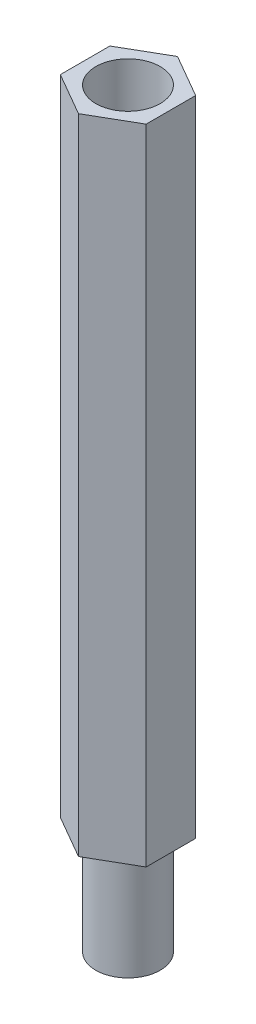
ISO-10303-21;
HEADER;
FILE_DESCRIPTION(('STEP AP214'),'2;1');
FILE_NAME('part.step','',(''),(''),'','','');
FILE_SCHEMA(('AUTOMOTIVE_DESIGN { 1 0 10303 214 1 1 1 1 }'));
ENDSEC;
DATA;
#1=APPLICATION_CONTEXT('core data for automotive mechanical design processes');
#2=APPLICATION_PROTOCOL_DEFINITION('international standard','automotive_design',2000,#1);
#3=PRODUCT_CONTEXT('',#1,'mechanical');
#4=PRODUCT('Part','Part','',(#3));
#5=PRODUCT_RELATED_PRODUCT_CATEGORY('part','',(#4));
#6=PRODUCT_DEFINITION_FORMATION('','',#4);
#7=PRODUCT_DEFINITION_CONTEXT('part definition',#1,'design');
#8=PRODUCT_DEFINITION('design','',#6,#7);
#9=PRODUCT_DEFINITION_SHAPE('','',#8);
#10=(LENGTH_UNIT() NAMED_UNIT(*) SI_UNIT(.MILLI.,.METRE.));
#11=(NAMED_UNIT(*) PLANE_ANGLE_UNIT() SI_UNIT($,.RADIAN.));
#12=(NAMED_UNIT(*) SI_UNIT($,.STERADIAN.) SOLID_ANGLE_UNIT());
#13=UNCERTAINTY_MEASURE_WITH_UNIT(LENGTH_MEASURE(1.E-05),#10,'distance_accuracy_value','');
#14=(GEOMETRIC_REPRESENTATION_CONTEXT(3) GLOBAL_UNCERTAINTY_ASSIGNED_CONTEXT((#13)) GLOBAL_UNIT_ASSIGNED_CONTEXT((#10,
#11,#12)) REPRESENTATION_CONTEXT('',''));
#15=CARTESIAN_POINT('',(0.,0.,0.));
#16=DIRECTION('',(0.,0.,1.));
#17=DIRECTION('',(1.,0.,0.));
#18=AXIS2_PLACEMENT_3D('',#15,#16,#17);
#19=CARTESIAN_POINT('',(0.,5.,0.));
#20=DIRECTION('',(0.,-1.,0.));
#21=DIRECTION('',(0.,0.,-1.));
#22=AXIS2_PLACEMENT_3D('',#19,#20,#21);
#23=CYLINDRICAL_SURFACE('',#22,1.5);
#24=CARTESIAN_POINT('',(0.,5.,0.));
#25=DIRECTION('',(0.,1.,0.));
#26=DIRECTION('',(0.,0.,1.));
#27=AXIS2_PLACEMENT_3D('',#24,#25,#26);
#28=CIRCLE('',#27,1.5);
#29=CARTESIAN_POINT('',(0.,5.,1.5));
#30=VERTEX_POINT('',#29);
#31=EDGE_CURVE('E11',#30,#30,#28,.T.);
#32=ORIENTED_EDGE('',*,*,#31,.F.);
#33=EDGE_LOOP('',(#32));
#34=FACE_BOUND('',#33,.T.);
#35=CARTESIAN_POINT('',(0.,0.,0.));
#36=DIRECTION('',(0.,1.,0.));
#37=DIRECTION('',(0.,0.,1.));
#38=AXIS2_PLACEMENT_3D('',#35,#36,#37);
#39=CIRCLE('',#38,1.5);
#40=CARTESIAN_POINT('',(0.,0.,1.5));
#41=VERTEX_POINT('',#40);
#42=EDGE_CURVE('E37',#41,#41,#39,.T.);
#43=ORIENTED_EDGE('',*,*,#42,.T.);
#44=EDGE_LOOP('',(#43));
#45=FACE_BOUND('',#44,.T.);
#46=ADVANCED_FACE('F34',(#34,#45),#23,.T.);
#47=CARTESIAN_POINT('',(0.,0.,0.));
#48=DIRECTION('',(0.,1.,0.));
#49=DIRECTION('',(0.,0.,1.));
#50=AXIS2_PLACEMENT_3D('',#47,#48,#49);
#51=PLANE('',#50);
#52=ORIENTED_EDGE('',*,*,#42,.F.);
#53=EDGE_LOOP('',(#52));
#54=FACE_BOUND('',#53,.T.);
#55=ADVANCED_FACE('F143',(#54),#51,.F.);
#56=CARTESIAN_POINT('',(2.,35.,-1.15470053837925));
#57=DIRECTION('',(-0.5,0.,0.866025403784438));
#58=DIRECTION('',(0.866025403784439,0.,0.5));
#59=AXIS2_PLACEMENT_3D('',#56,#57,#58);
#60=PLANE('',#59);
#61=DIRECTION('',(-0.866025403784438,0.,-0.5));
#62=VECTOR('',#61,1.);
#63=CARTESIAN_POINT('',(2.,5.,-1.15470053837925));
#64=LINE('',#63,#62);
#65=CARTESIAN_POINT('',(2.,5.,-1.15470053837925));
#66=VERTEX_POINT('',#65);
#67=CARTESIAN_POINT('',(0.,5.,-2.3094010767585));
#68=VERTEX_POINT('',#67);
#69=EDGE_CURVE('E119',#66,#68,#64,.T.);
#70=ORIENTED_EDGE('',*,*,#69,.T.);
#71=DIRECTION('',(0.,-1.,0.));
#72=VECTOR('',#71,1.);
#73=CARTESIAN_POINT('',(0.,35.,-2.3094010767585));
#74=LINE('',#73,#72);
#75=CARTESIAN_POINT('',(0.,35.,-2.3094010767585));
#76=VERTEX_POINT('',#75);
#77=EDGE_CURVE('E137',#76,#68,#74,.T.);
#78=ORIENTED_EDGE('',*,*,#77,.F.);
#79=DIRECTION('',(-0.866025403784438,0.,-0.5));
#80=VECTOR('',#79,1.);
#81=CARTESIAN_POINT('',(2.,35.,-1.15470053837925));
#82=LINE('',#81,#80);
#83=CARTESIAN_POINT('',(2.,35.,-1.15470053837925));
#84=VERTEX_POINT('',#83);
#85=EDGE_CURVE('E130',#84,#76,#82,.T.);
#86=ORIENTED_EDGE('',*,*,#85,.F.);
#87=DIRECTION('',(0.,-1.,0.));
#88=VECTOR('',#87,1.);
#89=CARTESIAN_POINT('',(2.,35.,-1.15470053837925));
#90=LINE('',#89,#88);
#91=EDGE_CURVE('E115',#84,#66,#90,.T.);
#92=ORIENTED_EDGE('',*,*,#91,.T.);
#93=EDGE_LOOP('',(#70,#78,#86,#92));
#94=FACE_BOUND('',#93,.T.);
#95=ADVANCED_FACE('F145',(#94),#60,.F.);
#96=CARTESIAN_POINT('',(0.,35.,-2.3094010767585));
#97=DIRECTION('',(0.5,0.,0.866025403784439));
#98=DIRECTION('',(0.866025403784439,0.,-0.5));
#99=AXIS2_PLACEMENT_3D('',#96,#97,#98);
#100=PLANE('',#99);
#101=DIRECTION('',(-0.866025403784439,0.,0.5));
#102=VECTOR('',#101,1.);
#103=CARTESIAN_POINT('',(0.,5.,-2.3094010767585));
#104=LINE('',#103,#102);
#105=CARTESIAN_POINT('',(-2.,5.,-1.15470053837925));
#106=VERTEX_POINT('',#105);
#107=EDGE_CURVE('E122',#68,#106,#104,.T.);
#108=ORIENTED_EDGE('',*,*,#107,.T.);
#109=DIRECTION('',(0.,-1.,0.));
#110=VECTOR('',#109,1.);
#111=CARTESIAN_POINT('',(-2.,35.,-1.15470053837925));
#112=LINE('',#111,#110);
#113=CARTESIAN_POINT('',(-2.,35.,-1.15470053837925));
#114=VERTEX_POINT('',#113);
#115=EDGE_CURVE('E134',#114,#106,#112,.T.);
#116=ORIENTED_EDGE('',*,*,#115,.F.);
#117=DIRECTION('',(-0.866025403784439,0.,0.5));
#118=VECTOR('',#117,1.);
#119=CARTESIAN_POINT('',(0.,35.,-2.3094010767585));
#120=LINE('',#119,#118);
#121=EDGE_CURVE('E88',#76,#114,#120,.T.);
#122=ORIENTED_EDGE('',*,*,#121,.F.);
#123=ORIENTED_EDGE('',*,*,#77,.T.);
#124=EDGE_LOOP('',(#108,#116,#122,#123));
#125=FACE_BOUND('',#124,.T.);
#126=ADVANCED_FACE('F150',(#125),#100,.F.);
#127=CARTESIAN_POINT('',(-2.,35.,-1.15470053837925));
#128=DIRECTION('',(1.,0.,0.));
#129=DIRECTION('',(0.,0.,-1.));
#130=AXIS2_PLACEMENT_3D('',#127,#128,#129);
#131=PLANE('',#130);
#132=DIRECTION('',(0.,0.,1.));
#133=VECTOR('',#132,1.);
#134=CARTESIAN_POINT('',(-2.,5.,-1.15470053837925));
#135=LINE('',#134,#133);
#136=CARTESIAN_POINT('',(-2.,5.,1.15470053837925));
#137=VERTEX_POINT('',#136);
#138=EDGE_CURVE('E125',#106,#137,#135,.T.);
#139=ORIENTED_EDGE('',*,*,#138,.T.);
#140=DIRECTION('',(0.,-1.,0.));
#141=VECTOR('',#140,1.);
#142=CARTESIAN_POINT('',(-2.,35.,1.15470053837925));
#143=LINE('',#142,#141);
#144=CARTESIAN_POINT('',(-2.,35.,1.15470053837925));
#145=VERTEX_POINT('',#144);
#146=EDGE_CURVE('E110',#145,#137,#143,.T.);
#147=ORIENTED_EDGE('',*,*,#146,.F.);
#148=DIRECTION('',(0.,0.,1.));
#149=VECTOR('',#148,1.);
#150=CARTESIAN_POINT('',(-2.,35.,-1.15470053837925));
#151=LINE('',#150,#149);
#152=EDGE_CURVE('E101',#114,#145,#151,.T.);
#153=ORIENTED_EDGE('',*,*,#152,.F.);
#154=ORIENTED_EDGE('',*,*,#115,.T.);
#155=EDGE_LOOP('',(#139,#147,#153,#154));
#156=FACE_BOUND('',#155,.T.);
#157=ADVANCED_FACE('F157',(#156),#131,.F.);
#158=CARTESIAN_POINT('',(-2.,35.,1.15470053837925));
#159=DIRECTION('',(0.5,0.,-0.866025403784438));
#160=DIRECTION('',(-0.866025403784438,0.,-0.5));
#161=AXIS2_PLACEMENT_3D('',#158,#159,#160);
#162=PLANE('',#161);
#163=DIRECTION('',(0.866025403784438,0.,0.5));
#164=VECTOR('',#163,1.);
#165=CARTESIAN_POINT('',(-2.,5.,1.15470053837925));
#166=LINE('',#165,#164);
#167=CARTESIAN_POINT('',(0.,5.,2.3094010767585));
#168=VERTEX_POINT('',#167);
#169=EDGE_CURVE('E109',#137,#168,#166,.T.);
#170=ORIENTED_EDGE('',*,*,#169,.T.);
#171=DIRECTION('',(0.,-1.,0.));
#172=VECTOR('',#171,1.);
#173=CARTESIAN_POINT('',(0.,35.,2.3094010767585));
#174=LINE('',#173,#172);
#175=CARTESIAN_POINT('',(0.,35.,2.3094010767585));
#176=VERTEX_POINT('',#175);
#177=EDGE_CURVE('E106',#176,#168,#174,.T.);
#178=ORIENTED_EDGE('',*,*,#177,.F.);
#179=DIRECTION('',(0.866025403784438,0.,0.5));
#180=VECTOR('',#179,1.);
#181=CARTESIAN_POINT('',(-2.,35.,1.15470053837925));
#182=LINE('',#181,#180);
#183=EDGE_CURVE('E95',#145,#176,#182,.T.);
#184=ORIENTED_EDGE('',*,*,#183,.F.);
#185=ORIENTED_EDGE('',*,*,#146,.T.);
#186=EDGE_LOOP('',(#170,#178,#184,#185));
#187=FACE_BOUND('',#186,.T.);
#188=ADVANCED_FACE('F107',(#187),#162,.F.);
#189=CARTESIAN_POINT('',(0.,35.,2.3094010767585));
#190=DIRECTION('',(-0.5,0.,-0.866025403784439));
#191=DIRECTION('',(-0.866025403784439,0.,0.5));
#192=AXIS2_PLACEMENT_3D('',#189,#190,#191);
#193=PLANE('',#192);
#194=DIRECTION('',(0.866025403784439,0.,-0.5));
#195=VECTOR('',#194,1.);
#196=CARTESIAN_POINT('',(0.,5.,2.3094010767585));
#197=LINE('',#196,#195);
#198=CARTESIAN_POINT('',(2.,5.,1.15470053837925));
#199=VERTEX_POINT('',#198);
#200=EDGE_CURVE('E73',#168,#199,#197,.T.);
#201=ORIENTED_EDGE('',*,*,#200,.T.);
#202=DIRECTION('',(0.,-1.,0.));
#203=VECTOR('',#202,1.);
#204=CARTESIAN_POINT('',(2.,35.,1.15470053837925));
#205=LINE('',#204,#203);
#206=CARTESIAN_POINT('',(2.,35.,1.15470053837925));
#207=VERTEX_POINT('',#206);
#208=EDGE_CURVE('E111',#207,#199,#205,.T.);
#209=ORIENTED_EDGE('',*,*,#208,.F.);
#210=DIRECTION('',(0.866025403784439,0.,-0.5));
#211=VECTOR('',#210,1.);
#212=CARTESIAN_POINT('',(0.,35.,2.3094010767585));
#213=LINE('',#212,#211);
#214=EDGE_CURVE('E99',#176,#207,#213,.T.);
#215=ORIENTED_EDGE('',*,*,#214,.F.);
#216=ORIENTED_EDGE('',*,*,#177,.T.);
#217=EDGE_LOOP('',(#201,#209,#215,#216));
#218=FACE_BOUND('',#217,.T.);
#219=ADVANCED_FACE('F113',(#218),#193,.F.);
#220=CARTESIAN_POINT('',(2.,35.,1.15470053837925));
#221=DIRECTION('',(-1.,0.,0.));
#222=DIRECTION('',(0.,0.,1.));
#223=AXIS2_PLACEMENT_3D('',#220,#221,#222);
#224=PLANE('',#223);
#225=DIRECTION('',(0.,0.,-1.));
#226=VECTOR('',#225,1.);
#227=CARTESIAN_POINT('',(2.,5.,1.15470053837925));
#228=LINE('',#227,#226);
#229=EDGE_CURVE('E79',#199,#66,#228,.T.);
#230=ORIENTED_EDGE('',*,*,#229,.T.);
#231=ORIENTED_EDGE('',*,*,#91,.F.);
#232=DIRECTION('',(0.,0.,-1.));
#233=VECTOR('',#232,1.);
#234=CARTESIAN_POINT('',(2.,35.,1.15470053837925));
#235=LINE('',#234,#233);
#236=EDGE_CURVE('E50',#207,#84,#235,.T.);
#237=ORIENTED_EDGE('',*,*,#236,.F.);
#238=ORIENTED_EDGE('',*,*,#208,.T.);
#239=EDGE_LOOP('',(#230,#231,#237,#238));
#240=FACE_BOUND('',#239,.T.);
#241=ADVANCED_FACE('F165',(#240),#224,.F.);
#242=CARTESIAN_POINT('',(0.,35.,0.));
#243=DIRECTION('',(0.,1.,0.));
#244=DIRECTION('',(0.,0.,1.));
#245=AXIS2_PLACEMENT_3D('',#242,#243,#244);
#246=PLANE('',#245);
#247=CARTESIAN_POINT('',(0.,35.,0.));
#248=DIRECTION('',(0.,1.,0.));
#249=DIRECTION('',(0.,0.,1.));
#250=AXIS2_PLACEMENT_3D('',#247,#248,#249);
#251=CIRCLE('',#250,1.5);
#252=CARTESIAN_POINT('',(0.,35.,1.5));
#253=VERTEX_POINT('',#252);
#254=EDGE_CURVE('E186',#253,#253,#251,.T.);
#255=ORIENTED_EDGE('',*,*,#254,.F.);
#256=EDGE_LOOP('',(#255));
#257=FACE_BOUND('',#256,.T.);
#258=ORIENTED_EDGE('',*,*,#85,.T.);
#259=ORIENTED_EDGE('',*,*,#121,.T.);
#260=ORIENTED_EDGE('',*,*,#152,.T.);
#261=ORIENTED_EDGE('',*,*,#183,.T.);
#262=ORIENTED_EDGE('',*,*,#214,.T.);
#263=ORIENTED_EDGE('',*,*,#236,.T.);
#264=EDGE_LOOP('',(#258,#259,#260,#261,#262,#263));
#265=FACE_BOUND('',#264,.T.);
#266=ADVANCED_FACE('F97',(#257,#265),#246,.T.);
#267=CARTESIAN_POINT('',(0.,5.,0.));
#268=DIRECTION('',(0.,1.,0.));
#269=DIRECTION('',(0.,0.,1.));
#270=AXIS2_PLACEMENT_3D('',#267,#268,#269);
#271=PLANE('',#270);
#272=ORIENTED_EDGE('',*,*,#31,.T.);
#273=EDGE_LOOP('',(#272));
#274=FACE_BOUND('',#273,.T.);
#275=ORIENTED_EDGE('',*,*,#69,.F.);
#276=ORIENTED_EDGE('',*,*,#229,.F.);
#277=ORIENTED_EDGE('',*,*,#200,.F.);
#278=ORIENTED_EDGE('',*,*,#169,.F.);
#279=ORIENTED_EDGE('',*,*,#138,.F.);
#280=ORIENTED_EDGE('',*,*,#107,.F.);
#281=EDGE_LOOP('',(#275,#276,#277,#278,#279,#280));
#282=FACE_BOUND('',#281,.T.);
#283=ADVANCED_FACE('F168',(#274,#282),#271,.F.);
#284=CARTESIAN_POINT('',(0.,30.,0.));
#285=DIRECTION('',(0.,1.,0.));
#286=DIRECTION('',(0.,0.,1.));
#287=AXIS2_PLACEMENT_3D('',#284,#285,#286);
#288=CYLINDRICAL_SURFACE('',#287,1.5);
#289=CARTESIAN_POINT('',(0.,30.,0.));
#290=DIRECTION('',(0.,1.,0.));
#291=DIRECTION('',(0.,0.,1.));
#292=AXIS2_PLACEMENT_3D('',#289,#290,#291);
#293=CIRCLE('',#292,1.5);
#294=CARTESIAN_POINT('',(0.,30.,1.5));
#295=VERTEX_POINT('',#294);
#296=EDGE_CURVE('E123',#295,#295,#293,.T.);
#297=ORIENTED_EDGE('',*,*,#296,.F.);
#298=EDGE_LOOP('',(#297));
#299=FACE_BOUND('',#298,.T.);
#300=ORIENTED_EDGE('',*,*,#254,.T.);
#301=EDGE_LOOP('',(#300));
#302=FACE_BOUND('',#301,.T.);
#303=ADVANCED_FACE('F171',(#299,#302),#288,.F.);
#304=CARTESIAN_POINT('',(0.,30.,0.));
#305=DIRECTION('',(0.,1.,0.));
#306=DIRECTION('',(0.,0.,1.));
#307=AXIS2_PLACEMENT_3D('',#304,#305,#306);
#308=PLANE('',#307);
#309=ORIENTED_EDGE('',*,*,#296,.T.);
#310=EDGE_LOOP('',(#309));
#311=FACE_BOUND('',#310,.T.);
#312=ADVANCED_FACE('F178',(#311),#308,.T.);
#313=CLOSED_SHELL('',(#46,#55,#95,#126,#157,#188,#219,#241,#266,#283,#303,#312));
#314=MANIFOLD_SOLID_BREP('B2',#313);
#315=ADVANCED_BREP_SHAPE_REPRESENTATION('',(#18,#314),#14);
#316=SHAPE_DEFINITION_REPRESENTATION(#9,#315);
ENDSEC;
END-ISO-10303-21;
